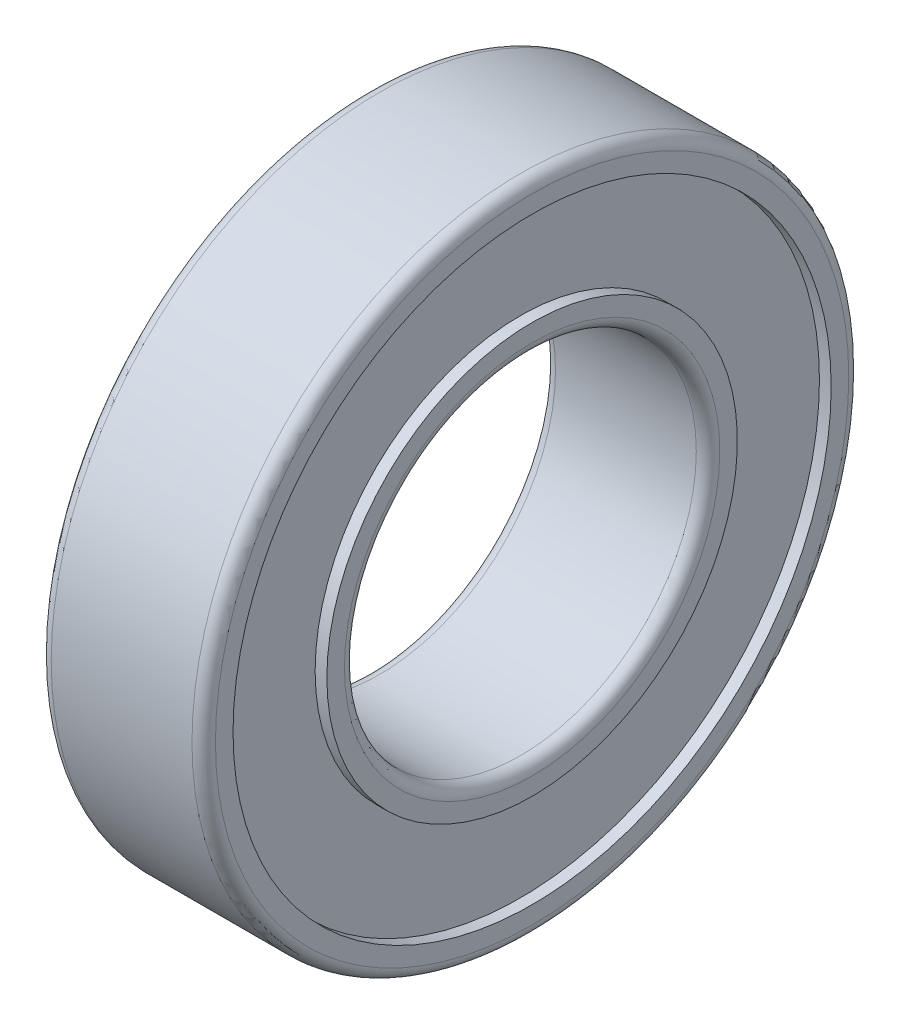
ISO-10303-21;
HEADER;
FILE_DESCRIPTION(('STEP AP214'),'2;1');
FILE_NAME('part.step','',(''),(''),'','','');
FILE_SCHEMA(('AUTOMOTIVE_DESIGN { 1 0 10303 214 1 1 1 1 }'));
ENDSEC;
DATA;
#1=APPLICATION_CONTEXT('core data for automotive mechanical design processes');
#2=APPLICATION_PROTOCOL_DEFINITION('international standard','automotive_design',2000,#1);
#3=PRODUCT_CONTEXT('',#1,'mechanical');
#4=PRODUCT('Part','Part','',(#3));
#5=PRODUCT_RELATED_PRODUCT_CATEGORY('part','',(#4));
#6=PRODUCT_DEFINITION_FORMATION('','',#4);
#7=PRODUCT_DEFINITION_CONTEXT('part definition',#1,'design');
#8=PRODUCT_DEFINITION('design','',#6,#7);
#9=PRODUCT_DEFINITION_SHAPE('','',#8);
#10=(LENGTH_UNIT() NAMED_UNIT(*) SI_UNIT(.MILLI.,.METRE.));
#11=(NAMED_UNIT(*) PLANE_ANGLE_UNIT() SI_UNIT($,.RADIAN.));
#12=(NAMED_UNIT(*) SI_UNIT($,.STERADIAN.) SOLID_ANGLE_UNIT());
#13=UNCERTAINTY_MEASURE_WITH_UNIT(LENGTH_MEASURE(1.E-05),#10,'distance_accuracy_value','');
#14=(GEOMETRIC_REPRESENTATION_CONTEXT(3) GLOBAL_UNCERTAINTY_ASSIGNED_CONTEXT((#13)) GLOBAL_UNIT_ASSIGNED_CONTEXT((#10,
#11,#12)) REPRESENTATION_CONTEXT('',''));
#15=CARTESIAN_POINT('',(0.,0.,0.));
#16=DIRECTION('',(0.,0.,1.));
#17=DIRECTION('',(1.,0.,0.));
#18=AXIS2_PLACEMENT_3D('',#15,#16,#17);
#19=CARTESIAN_POINT('',(0.5,12.75,0.));
#20=DIRECTION('',(1.,0.,0.));
#21=DIRECTION('',(0.,0.,-1.));
#22=AXIS2_PLACEMENT_3D('',#19,#20,#21);
#23=PLANE('',#22);
#24=CARTESIAN_POINT('',(0.5,0.,0.));
#25=DIRECTION('',(-1.,0.,0.));
#26=DIRECTION('',(0.,0.,1.));
#27=AXIS2_PLACEMENT_3D('',#24,#25,#26);
#28=CIRCLE('',#27,12.75);
#29=CARTESIAN_POINT('',(0.5,0.,12.75));
#30=VERTEX_POINT('',#29);
#31=EDGE_CURVE('E297',#30,#30,#28,.T.);
#32=ORIENTED_EDGE('',*,*,#31,.T.);
#33=EDGE_LOOP('',(#32));
#34=FACE_BOUND('',#33,.T.);
#35=CARTESIAN_POINT('',(0.5,0.,0.));
#36=DIRECTION('',(-1.,0.,0.));
#37=DIRECTION('',(0.,0.,1.));
#38=AXIS2_PLACEMENT_3D('',#35,#36,#37);
#39=CIRCLE('',#38,8.75);
#40=CARTESIAN_POINT('',(0.5,0.,8.75));
#41=VERTEX_POINT('',#40);
#42=EDGE_CURVE('E295',#41,#41,#39,.T.);
#43=ORIENTED_EDGE('',*,*,#42,.F.);
#44=EDGE_LOOP('',(#43));
#45=FACE_BOUND('',#44,.T.);
#46=ADVANCED_FACE('F16',(#34,#45),#23,.F.);
#47=CARTESIAN_POINT('',(0.,0.,0.));
#48=DIRECTION('',(-1.,0.,0.));
#49=DIRECTION('',(0.,0.,1.));
#50=AXIS2_PLACEMENT_3D('',#47,#48,#49);
#51=CYLINDRICAL_SURFACE('',#50,12.75);
#52=ORIENTED_EDGE('',*,*,#31,.F.);
#53=EDGE_LOOP('',(#52));
#54=FACE_BOUND('',#53,.T.);
#55=CARTESIAN_POINT('',(0.,0.,0.));
#56=DIRECTION('',(-1.,0.,0.));
#57=DIRECTION('',(0.,0.,1.));
#58=AXIS2_PLACEMENT_3D('',#55,#56,#57);
#59=CIRCLE('',#58,12.75);
#60=CARTESIAN_POINT('',(0.,0.,12.75));
#61=VERTEX_POINT('',#60);
#62=EDGE_CURVE('E292',#61,#61,#59,.T.);
#63=ORIENTED_EDGE('',*,*,#62,.T.);
#64=EDGE_LOOP('',(#63));
#65=FACE_BOUND('',#64,.T.);
#66=ADVANCED_FACE('F101',(#54,#65),#51,.F.);
#67=CARTESIAN_POINT('',(0.,0.,0.));
#68=DIRECTION('',(-1.,0.,0.));
#69=DIRECTION('',(0.,0.,1.));
#70=AXIS2_PLACEMENT_3D('',#67,#68,#69);
#71=CYLINDRICAL_SURFACE('',#70,8.75);
#72=CARTESIAN_POINT('',(0.,0.,0.));
#73=DIRECTION('',(-1.,0.,0.));
#74=DIRECTION('',(0.,0.,1.));
#75=AXIS2_PLACEMENT_3D('',#72,#73,#74);
#76=CIRCLE('',#75,8.75);
#77=CARTESIAN_POINT('',(0.,0.,8.75));
#78=VERTEX_POINT('',#77);
#79=EDGE_CURVE('E69',#78,#78,#76,.F.);
#80=ORIENTED_EDGE('',*,*,#79,.T.);
#81=EDGE_LOOP('',(#80));
#82=FACE_BOUND('',#81,.T.);
#83=ORIENTED_EDGE('',*,*,#42,.T.);
#84=EDGE_LOOP('',(#83));
#85=FACE_BOUND('',#84,.T.);
#86=ADVANCED_FACE('F89',(#82,#85),#71,.T.);
#87=CARTESIAN_POINT('',(0.,14.,0.));
#88=DIRECTION('',(1.,0.,0.));
#89=DIRECTION('',(0.,0.,-1.));
#90=AXIS2_PLACEMENT_3D('',#87,#88,#89);
#91=PLANE('',#90);
#92=ORIENTED_EDGE('',*,*,#62,.F.);
#93=EDGE_LOOP('',(#92));
#94=FACE_BOUND('',#93,.T.);
#95=CARTESIAN_POINT('',(0.,0.,0.));
#96=DIRECTION('',(1.,0.,0.));
#97=DIRECTION('',(0.,0.,-1.));
#98=AXIS2_PLACEMENT_3D('',#95,#96,#97);
#99=CIRCLE('',#98,13.5);
#100=CARTESIAN_POINT('',(0.,0.,-13.5));
#101=VERTEX_POINT('',#100);
#102=CARTESIAN_POINT('',(0.,0.,13.5));
#103=VERTEX_POINT('',#102);
#104=EDGE_CURVE('E56',#101,#103,#99,.T.);
#105=ORIENTED_EDGE('',*,*,#104,.F.);
#106=CARTESIAN_POINT('',(0.,0.,0.));
#107=DIRECTION('',(1.,0.,0.));
#108=DIRECTION('',(0.,0.,1.));
#109=AXIS2_PLACEMENT_3D('',#106,#107,#108);
#110=CIRCLE('',#109,13.5);
#111=EDGE_CURVE('E58',#103,#101,#110,.T.);
#112=ORIENTED_EDGE('',*,*,#111,.F.);
#113=EDGE_LOOP('',(#105,#112));
#114=FACE_BOUND('',#113,.T.);
#115=ADVANCED_FACE('F68',(#94,#114),#91,.F.);
#116=CARTESIAN_POINT('',(0.,8.75,0.));
#117=DIRECTION('',(1.,0.,0.));
#118=DIRECTION('',(0.,0.,-1.));
#119=AXIS2_PLACEMENT_3D('',#116,#117,#118);
#120=PLANE('',#119);
#121=ORIENTED_EDGE('',*,*,#79,.F.);
#122=EDGE_LOOP('',(#121));
#123=FACE_BOUND('',#122,.T.);
#124=CARTESIAN_POINT('',(0.,0.,0.));
#125=DIRECTION('',(-1.,0.,0.));
#126=DIRECTION('',(0.,0.,-1.));
#127=AXIS2_PLACEMENT_3D('',#124,#125,#126);
#128=CIRCLE('',#127,8.);
#129=CARTESIAN_POINT('',(0.,0.,-8.));
#130=VERTEX_POINT('',#129);
#131=CARTESIAN_POINT('',(0.,0.,8.));
#132=VERTEX_POINT('',#131);
#133=EDGE_CURVE('E64',#130,#132,#128,.T.);
#134=ORIENTED_EDGE('',*,*,#133,.F.);
#135=CARTESIAN_POINT('',(0.,0.,0.));
#136=DIRECTION('',(-1.,0.,0.));
#137=DIRECTION('',(0.,0.,1.));
#138=AXIS2_PLACEMENT_3D('',#135,#136,#137);
#139=CIRCLE('',#138,8.);
#140=EDGE_CURVE('E239',#132,#130,#139,.T.);
#141=ORIENTED_EDGE('',*,*,#140,.F.);
#142=EDGE_LOOP('',(#134,#141));
#143=FACE_BOUND('',#142,.T.);
#144=ADVANCED_FACE('F88',(#123,#143),#120,.F.);
#145=CARTESIAN_POINT('',(0.500000000000002,0.,0.));
#146=DIRECTION('',(1.,0.,0.));
#147=DIRECTION('',(0.,0.,-1.));
#148=AXIS2_PLACEMENT_3D('',#145,#146,#147);
#149=TOROIDAL_SURFACE('',#148,13.5,0.5);
#150=ORIENTED_EDGE('',*,*,#104,.T.);
#151=ORIENTED_EDGE('',*,*,#111,.T.);
#152=EDGE_LOOP('',(#150,#151));
#153=FACE_BOUND('',#152,.T.);
#154=CARTESIAN_POINT('',(0.500000000000002,0.,0.));
#155=DIRECTION('',(-1.,0.,0.));
#156=DIRECTION('',(0.,0.,1.));
#157=AXIS2_PLACEMENT_3D('',#154,#155,#156);
#158=CIRCLE('',#157,14.);
#159=CARTESIAN_POINT('',(0.500000000000002,0.,14.));
#160=VERTEX_POINT('',#159);
#161=EDGE_CURVE('E236',#160,#160,#158,.F.);
#162=ORIENTED_EDGE('',*,*,#161,.F.);
#163=EDGE_LOOP('',(#162));
#164=FACE_BOUND('',#163,.T.);
#165=ADVANCED_FACE('F60',(#153,#164),#149,.T.);
#166=CARTESIAN_POINT('',(0.5,0.,0.));
#167=DIRECTION('',(1.,0.,0.));
#168=DIRECTION('',(0.,0.,-1.));
#169=AXIS2_PLACEMENT_3D('',#166,#167,#168);
#170=TOROIDAL_SURFACE('',#169,8.,0.5);
#171=ORIENTED_EDGE('',*,*,#133,.T.);
#172=ORIENTED_EDGE('',*,*,#140,.T.);
#173=EDGE_LOOP('',(#171,#172));
#174=FACE_BOUND('',#173,.T.);
#175=CARTESIAN_POINT('',(0.5,0.,0.));
#176=DIRECTION('',(-1.,0.,0.));
#177=DIRECTION('',(0.,0.,1.));
#178=AXIS2_PLACEMENT_3D('',#175,#176,#177);
#179=CIRCLE('',#178,7.5);
#180=CARTESIAN_POINT('',(0.5,0.,7.5));
#181=VERTEX_POINT('',#180);
#182=EDGE_CURVE('E232',#181,#181,#179,.F.);
#183=ORIENTED_EDGE('',*,*,#182,.T.);
#184=EDGE_LOOP('',(#183));
#185=FACE_BOUND('',#184,.T.);
#186=ADVANCED_FACE('F216',(#174,#185),#170,.T.);
#187=CARTESIAN_POINT('',(0.,0.,0.));
#188=DIRECTION('',(-1.,0.,0.));
#189=DIRECTION('',(0.,0.,1.));
#190=AXIS2_PLACEMENT_3D('',#187,#188,#189);
#191=CYLINDRICAL_SURFACE('',#190,14.);
#192=CARTESIAN_POINT('',(6.5,0.,0.));
#193=DIRECTION('',(-1.,0.,0.));
#194=DIRECTION('',(0.,0.,1.));
#195=AXIS2_PLACEMENT_3D('',#192,#193,#194);
#196=CIRCLE('',#195,14.);
#197=CARTESIAN_POINT('',(6.5,0.,14.));
#198=VERTEX_POINT('',#197);
#199=EDGE_CURVE('E262',#198,#198,#196,.F.);
#200=ORIENTED_EDGE('',*,*,#199,.F.);
#201=EDGE_LOOP('',(#200));
#202=FACE_BOUND('',#201,.T.);
#203=ORIENTED_EDGE('',*,*,#161,.T.);
#204=EDGE_LOOP('',(#203));
#205=FACE_BOUND('',#204,.T.);
#206=ADVANCED_FACE('F226',(#202,#205),#191,.T.);
#207=CARTESIAN_POINT('',(0.,0.,0.));
#208=DIRECTION('',(-1.,0.,0.));
#209=DIRECTION('',(0.,0.,1.));
#210=AXIS2_PLACEMENT_3D('',#207,#208,#209);
#211=CYLINDRICAL_SURFACE('',#210,7.5);
#212=CARTESIAN_POINT('',(6.5,0.,0.));
#213=DIRECTION('',(-1.,0.,0.));
#214=DIRECTION('',(0.,0.,1.));
#215=AXIS2_PLACEMENT_3D('',#212,#213,#214);
#216=CIRCLE('',#215,7.5);
#217=CARTESIAN_POINT('',(6.5,0.,7.5));
#218=VERTEX_POINT('',#217);
#219=EDGE_CURVE('E264',#218,#218,#216,.T.);
#220=ORIENTED_EDGE('',*,*,#219,.F.);
#221=EDGE_LOOP('',(#220));
#222=FACE_BOUND('',#221,.T.);
#223=ORIENTED_EDGE('',*,*,#182,.F.);
#224=EDGE_LOOP('',(#223));
#225=FACE_BOUND('',#224,.T.);
#226=ADVANCED_FACE('F323',(#222,#225),#211,.F.);
#227=CARTESIAN_POINT('',(6.5,0.,0.));
#228=DIRECTION('',(-1.,0.,0.));
#229=DIRECTION('',(0.,0.,1.));
#230=AXIS2_PLACEMENT_3D('',#227,#228,#229);
#231=TOROIDAL_SURFACE('',#230,13.5,0.5);
#232=CARTESIAN_POINT('',(7.,0.,0.));
#233=DIRECTION('',(-1.,0.,0.));
#234=DIRECTION('',(0.,0.,1.));
#235=AXIS2_PLACEMENT_3D('',#232,#233,#234);
#236=CIRCLE('',#235,13.5);
#237=CARTESIAN_POINT('',(7.,0.,13.5));
#238=VERTEX_POINT('',#237);
#239=CARTESIAN_POINT('',(7.,0.,-13.5));
#240=VERTEX_POINT('',#239);
#241=EDGE_CURVE('E154',#238,#240,#236,.T.);
#242=ORIENTED_EDGE('',*,*,#241,.T.);
#243=CARTESIAN_POINT('',(7.,0.,0.));
#244=DIRECTION('',(-1.,0.,0.));
#245=DIRECTION('',(0.,0.,-1.));
#246=AXIS2_PLACEMENT_3D('',#243,#244,#245);
#247=CIRCLE('',#246,13.5);
#248=EDGE_CURVE('E165',#240,#238,#247,.T.);
#249=ORIENTED_EDGE('',*,*,#248,.T.);
#250=EDGE_LOOP('',(#242,#249));
#251=FACE_BOUND('',#250,.T.);
#252=ORIENTED_EDGE('',*,*,#199,.T.);
#253=EDGE_LOOP('',(#252));
#254=FACE_BOUND('',#253,.T.);
#255=ADVANCED_FACE('F181',(#251,#254),#231,.T.);
#256=CARTESIAN_POINT('',(6.5,0.,0.));
#257=DIRECTION('',(-1.,0.,0.));
#258=DIRECTION('',(0.,0.,1.));
#259=AXIS2_PLACEMENT_3D('',#256,#257,#258);
#260=TOROIDAL_SURFACE('',#259,8.,0.5);
#261=CARTESIAN_POINT('',(7.,0.,0.));
#262=DIRECTION('',(1.,0.,0.));
#263=DIRECTION('',(0.,0.,1.));
#264=AXIS2_PLACEMENT_3D('',#261,#262,#263);
#265=CIRCLE('',#264,8.);
#266=CARTESIAN_POINT('',(7.,0.,8.));
#267=VERTEX_POINT('',#266);
#268=CARTESIAN_POINT('',(7.,0.,-8.));
#269=VERTEX_POINT('',#268);
#270=EDGE_CURVE('E279',#267,#269,#265,.T.);
#271=ORIENTED_EDGE('',*,*,#270,.T.);
#272=CARTESIAN_POINT('',(7.,0.,0.));
#273=DIRECTION('',(1.,0.,0.));
#274=DIRECTION('',(0.,0.,-1.));
#275=AXIS2_PLACEMENT_3D('',#272,#273,#274);
#276=CIRCLE('',#275,8.);
#277=EDGE_CURVE('E35',#269,#267,#276,.T.);
#278=ORIENTED_EDGE('',*,*,#277,.T.);
#279=EDGE_LOOP('',(#271,#278));
#280=FACE_BOUND('',#279,.T.);
#281=ORIENTED_EDGE('',*,*,#219,.T.);
#282=EDGE_LOOP('',(#281));
#283=FACE_BOUND('',#282,.T.);
#284=ADVANCED_FACE('F177',(#280,#283),#260,.T.);
#285=CARTESIAN_POINT('',(7.,12.75,0.));
#286=DIRECTION('',(-1.,0.,0.));
#287=DIRECTION('',(0.,0.,1.));
#288=AXIS2_PLACEMENT_3D('',#285,#286,#287);
#289=PLANE('',#288);
#290=CARTESIAN_POINT('',(7.,0.,0.));
#291=DIRECTION('',(-1.,0.,0.));
#292=DIRECTION('',(0.,0.,1.));
#293=AXIS2_PLACEMENT_3D('',#290,#291,#292);
#294=CIRCLE('',#293,12.75);
#295=CARTESIAN_POINT('',(7.,0.,12.75));
#296=VERTEX_POINT('',#295);
#297=EDGE_CURVE('E280',#296,#296,#294,.T.);
#298=ORIENTED_EDGE('',*,*,#297,.T.);
#299=EDGE_LOOP('',(#298));
#300=FACE_BOUND('',#299,.T.);
#301=ORIENTED_EDGE('',*,*,#241,.F.);
#302=ORIENTED_EDGE('',*,*,#248,.F.);
#303=EDGE_LOOP('',(#301,#302));
#304=FACE_BOUND('',#303,.T.);
#305=ADVANCED_FACE('F133',(#300,#304),#289,.F.);
#306=CARTESIAN_POINT('',(7.,7.5,0.));
#307=DIRECTION('',(-1.,0.,0.));
#308=DIRECTION('',(0.,0.,1.));
#309=AXIS2_PLACEMENT_3D('',#306,#307,#308);
#310=PLANE('',#309);
#311=CARTESIAN_POINT('',(7.,0.,0.));
#312=DIRECTION('',(-1.,0.,0.));
#313=DIRECTION('',(0.,0.,1.));
#314=AXIS2_PLACEMENT_3D('',#311,#312,#313);
#315=CIRCLE('',#314,8.75);
#316=CARTESIAN_POINT('',(7.,0.,8.75));
#317=VERTEX_POINT('',#316);
#318=EDGE_CURVE('E282',#317,#317,#315,.T.);
#319=ORIENTED_EDGE('',*,*,#318,.F.);
#320=EDGE_LOOP('',(#319));
#321=FACE_BOUND('',#320,.T.);
#322=ORIENTED_EDGE('',*,*,#270,.F.);
#323=ORIENTED_EDGE('',*,*,#277,.F.);
#324=EDGE_LOOP('',(#322,#323));
#325=FACE_BOUND('',#324,.T.);
#326=ADVANCED_FACE('F128',(#321,#325),#310,.F.);
#327=CARTESIAN_POINT('',(0.,0.,0.));
#328=DIRECTION('',(-1.,0.,0.));
#329=DIRECTION('',(0.,0.,1.));
#330=AXIS2_PLACEMENT_3D('',#327,#328,#329);
#331=CYLINDRICAL_SURFACE('',#330,12.75);
#332=ORIENTED_EDGE('',*,*,#297,.F.);
#333=EDGE_LOOP('',(#332));
#334=FACE_BOUND('',#333,.T.);
#335=CARTESIAN_POINT('',(6.5,0.,0.));
#336=DIRECTION('',(-1.,0.,0.));
#337=DIRECTION('',(0.,0.,1.));
#338=AXIS2_PLACEMENT_3D('',#335,#336,#337);
#339=CIRCLE('',#338,12.75);
#340=CARTESIAN_POINT('',(6.5,0.,12.75));
#341=VERTEX_POINT('',#340);
#342=EDGE_CURVE('E27',#341,#341,#339,.T.);
#343=ORIENTED_EDGE('',*,*,#342,.T.);
#344=EDGE_LOOP('',(#343));
#345=FACE_BOUND('',#344,.T.);
#346=ADVANCED_FACE('F120',(#334,#345),#331,.F.);
#347=CARTESIAN_POINT('',(0.,0.,0.));
#348=DIRECTION('',(-1.,0.,0.));
#349=DIRECTION('',(0.,0.,1.));
#350=AXIS2_PLACEMENT_3D('',#347,#348,#349);
#351=CYLINDRICAL_SURFACE('',#350,8.75);
#352=CARTESIAN_POINT('',(6.5,0.,0.));
#353=DIRECTION('',(-1.,0.,0.));
#354=DIRECTION('',(0.,0.,1.));
#355=AXIS2_PLACEMENT_3D('',#352,#353,#354);
#356=CIRCLE('',#355,8.75);
#357=CARTESIAN_POINT('',(6.5,0.,8.75));
#358=VERTEX_POINT('',#357);
#359=EDGE_CURVE('E11',#358,#358,#356,.F.);
#360=ORIENTED_EDGE('',*,*,#359,.T.);
#361=EDGE_LOOP('',(#360));
#362=FACE_BOUND('',#361,.T.);
#363=ORIENTED_EDGE('',*,*,#318,.T.);
#364=EDGE_LOOP('',(#363));
#365=FACE_BOUND('',#364,.T.);
#366=ADVANCED_FACE('F114',(#362,#365),#351,.T.);
#367=CARTESIAN_POINT('',(6.5,8.75,0.));
#368=DIRECTION('',(-1.,0.,0.));
#369=DIRECTION('',(0.,0.,1.));
#370=AXIS2_PLACEMENT_3D('',#367,#368,#369);
#371=PLANE('',#370);
#372=ORIENTED_EDGE('',*,*,#359,.F.);
#373=EDGE_LOOP('',(#372));
#374=FACE_BOUND('',#373,.T.);
#375=ORIENTED_EDGE('',*,*,#342,.F.);
#376=EDGE_LOOP('',(#375));
#377=FACE_BOUND('',#376,.T.);
#378=ADVANCED_FACE('F112',(#374,#377),#371,.F.);
#379=CLOSED_SHELL('',(#46,#66,#86,#115,#144,#165,#186,#206,#226,#255,#284,#305,#326,#346,#366,#378));
#380=MANIFOLD_SOLID_BREP('B1',#379);
#381=ADVANCED_BREP_SHAPE_REPRESENTATION('',(#18,#380),#14);
#382=SHAPE_DEFINITION_REPRESENTATION(#9,#381);
ENDSEC;
END-ISO-10303-21;
